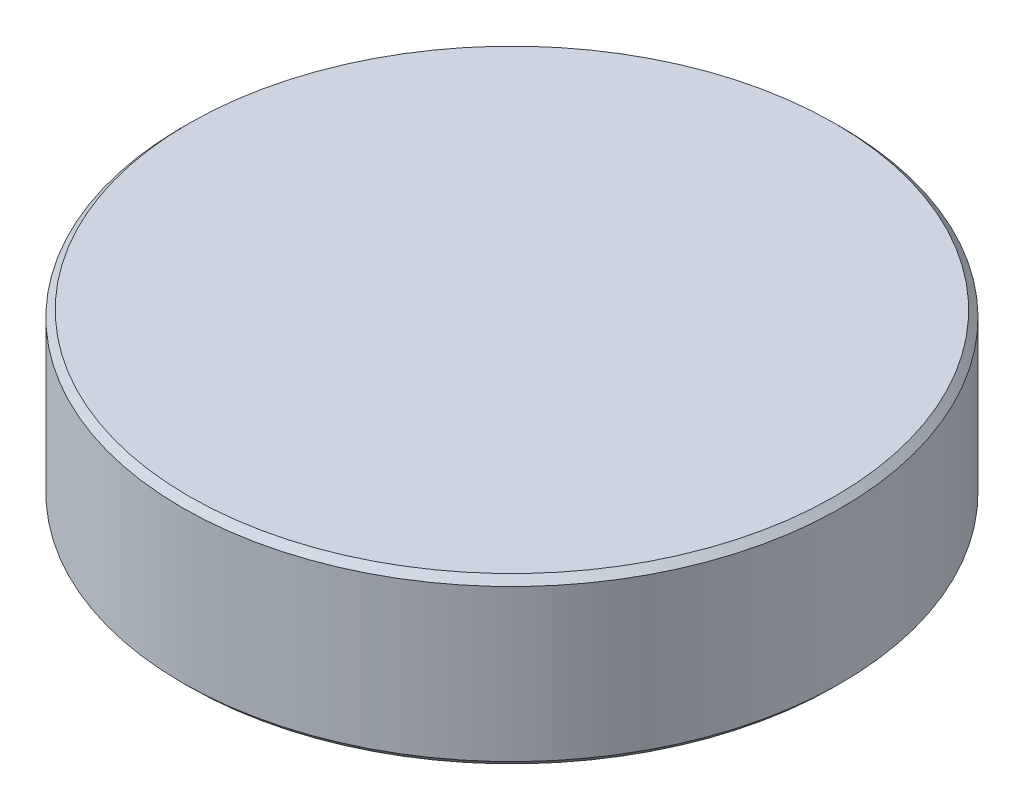
ISO-10303-21;
HEADER;
FILE_DESCRIPTION(('STEP AP214'),'2;1');
FILE_NAME('part.step','',(''),(''),'','','');
FILE_SCHEMA(('AUTOMOTIVE_DESIGN { 1 0 10303 214 1 1 1 1 }'));
ENDSEC;
DATA;
#1=APPLICATION_CONTEXT('core data for automotive mechanical design processes');
#2=APPLICATION_PROTOCOL_DEFINITION('international standard','automotive_design',2000,#1);
#3=PRODUCT_CONTEXT('',#1,'mechanical');
#4=PRODUCT('Part','Part','',(#3));
#5=PRODUCT_RELATED_PRODUCT_CATEGORY('part','',(#4));
#6=PRODUCT_DEFINITION_FORMATION('','',#4);
#7=PRODUCT_DEFINITION_CONTEXT('part definition',#1,'design');
#8=PRODUCT_DEFINITION('design','',#6,#7);
#9=PRODUCT_DEFINITION_SHAPE('','',#8);
#10=(LENGTH_UNIT() NAMED_UNIT(*) SI_UNIT(.MILLI.,.METRE.));
#11=(NAMED_UNIT(*) PLANE_ANGLE_UNIT() SI_UNIT($,.RADIAN.));
#12=(NAMED_UNIT(*) SI_UNIT($,.STERADIAN.) SOLID_ANGLE_UNIT());
#13=UNCERTAINTY_MEASURE_WITH_UNIT(LENGTH_MEASURE(1.E-05),#10,'distance_accuracy_value','');
#14=(GEOMETRIC_REPRESENTATION_CONTEXT(3) GLOBAL_UNCERTAINTY_ASSIGNED_CONTEXT((#13)) GLOBAL_UNIT_ASSIGNED_CONTEXT((#10,
#11,#12)) REPRESENTATION_CONTEXT('',''));
#15=CARTESIAN_POINT('',(0.,0.,0.));
#16=DIRECTION('',(0.,0.,1.));
#17=DIRECTION('',(1.,0.,0.));
#18=AXIS2_PLACEMENT_3D('',#15,#16,#17);
#19=CARTESIAN_POINT('',(0.,25.,0.));
#20=DIRECTION('',(0.,1.,0.));
#21=DIRECTION('',(0.,0.,1.));
#22=AXIS2_PLACEMENT_3D('',#19,#20,#21);
#23=PLANE('',#22);
#24=CARTESIAN_POINT('',(0.,25.,0.));
#25=DIRECTION('',(0.,1.,0.));
#26=DIRECTION('',(0.,0.,1.));
#27=AXIS2_PLACEMENT_3D('',#24,#25,#26);
#28=CIRCLE('',#27,98.);
#29=CARTESIAN_POINT('',(0.,25.,98.));
#30=VERTEX_POINT('',#29);
#31=EDGE_CURVE('E10',#30,#30,#28,.T.);
#32=ORIENTED_EDGE('',*,*,#31,.T.);
#33=EDGE_LOOP('',(#32));
#34=FACE_BOUND('',#33,.T.);
#35=ADVANCED_FACE('F29',(#34),#23,.T.);
#36=CARTESIAN_POINT('',(0.,25.,0.));
#37=DIRECTION('',(0.,-1.,0.));
#38=DIRECTION('',(0.,0.,-1.));
#39=AXIS2_PLACEMENT_3D('',#36,#37,#38);
#40=CONICAL_SURFACE('',#39,98.,0.785398163397448);
#41=CARTESIAN_POINT('',(0.,23.,0.));
#42=DIRECTION('',(0.,1.,0.));
#43=DIRECTION('',(0.,0.,1.));
#44=AXIS2_PLACEMENT_3D('',#41,#42,#43);
#45=CIRCLE('',#44,100.);
#46=CARTESIAN_POINT('',(0.,23.,100.));
#47=VERTEX_POINT('',#46);
#48=EDGE_CURVE('E35',#47,#47,#45,.T.);
#49=ORIENTED_EDGE('',*,*,#48,.T.);
#50=EDGE_LOOP('',(#49));
#51=FACE_BOUND('',#50,.T.);
#52=ORIENTED_EDGE('',*,*,#31,.F.);
#53=EDGE_LOOP('',(#52));
#54=FACE_BOUND('',#53,.T.);
#55=ADVANCED_FACE('F61',(#51,#54),#40,.T.);
#56=CARTESIAN_POINT('',(0.,25.,0.));
#57=DIRECTION('',(0.,1.,0.));
#58=DIRECTION('',(0.,0.,1.));
#59=AXIS2_PLACEMENT_3D('',#56,#57,#58);
#60=CYLINDRICAL_SURFACE('',#59,100.);
#61=CARTESIAN_POINT('',(0.,-23.,0.));
#62=DIRECTION('',(0.,1.,0.));
#63=DIRECTION('',(0.,0.,1.));
#64=AXIS2_PLACEMENT_3D('',#61,#62,#63);
#65=CIRCLE('',#64,100.);
#66=CARTESIAN_POINT('',(0.,-23.,100.));
#67=VERTEX_POINT('',#66);
#68=EDGE_CURVE('E39',#67,#67,#65,.T.);
#69=ORIENTED_EDGE('',*,*,#68,.T.);
#70=EDGE_LOOP('',(#69));
#71=FACE_BOUND('',#70,.T.);
#72=ORIENTED_EDGE('',*,*,#48,.F.);
#73=EDGE_LOOP('',(#72));
#74=FACE_BOUND('',#73,.T.);
#75=ADVANCED_FACE('F58',(#71,#74),#60,.T.);
#76=CARTESIAN_POINT('',(0.,-23.,0.));
#77=DIRECTION('',(0.,1.,0.));
#78=DIRECTION('',(0.,0.,1.));
#79=AXIS2_PLACEMENT_3D('',#76,#77,#78);
#80=CONICAL_SURFACE('',#79,100.,0.785398163397448);
#81=CARTESIAN_POINT('',(0.,-25.,0.));
#82=DIRECTION('',(0.,1.,0.));
#83=DIRECTION('',(0.,0.,1.));
#84=AXIS2_PLACEMENT_3D('',#81,#82,#83);
#85=CIRCLE('',#84,98.);
#86=CARTESIAN_POINT('',(0.,-25.,98.));
#87=VERTEX_POINT('',#86);
#88=EDGE_CURVE('E43',#87,#87,#85,.T.);
#89=ORIENTED_EDGE('',*,*,#88,.T.);
#90=EDGE_LOOP('',(#89));
#91=FACE_BOUND('',#90,.T.);
#92=ORIENTED_EDGE('',*,*,#68,.F.);
#93=EDGE_LOOP('',(#92));
#94=FACE_BOUND('',#93,.T.);
#95=ADVANCED_FACE('F49',(#91,#94),#80,.T.);
#96=CARTESIAN_POINT('',(-98.,-25.,0.));
#97=DIRECTION('',(0.,-1.,0.));
#98=DIRECTION('',(0.,0.,-1.));
#99=AXIS2_PLACEMENT_3D('',#96,#97,#98);
#100=PLANE('',#99);
#101=ORIENTED_EDGE('',*,*,#88,.F.);
#102=EDGE_LOOP('',(#101));
#103=FACE_BOUND('',#102,.T.);
#104=ADVANCED_FACE('F52',(#103),#100,.T.);
#105=CLOSED_SHELL('',(#35,#55,#75,#95,#104));
#106=MANIFOLD_SOLID_BREP('B2',#105);
#107=ADVANCED_BREP_SHAPE_REPRESENTATION('',(#18,#106),#14);
#108=SHAPE_DEFINITION_REPRESENTATION(#9,#107);
ENDSEC;
END-ISO-10303-21;
